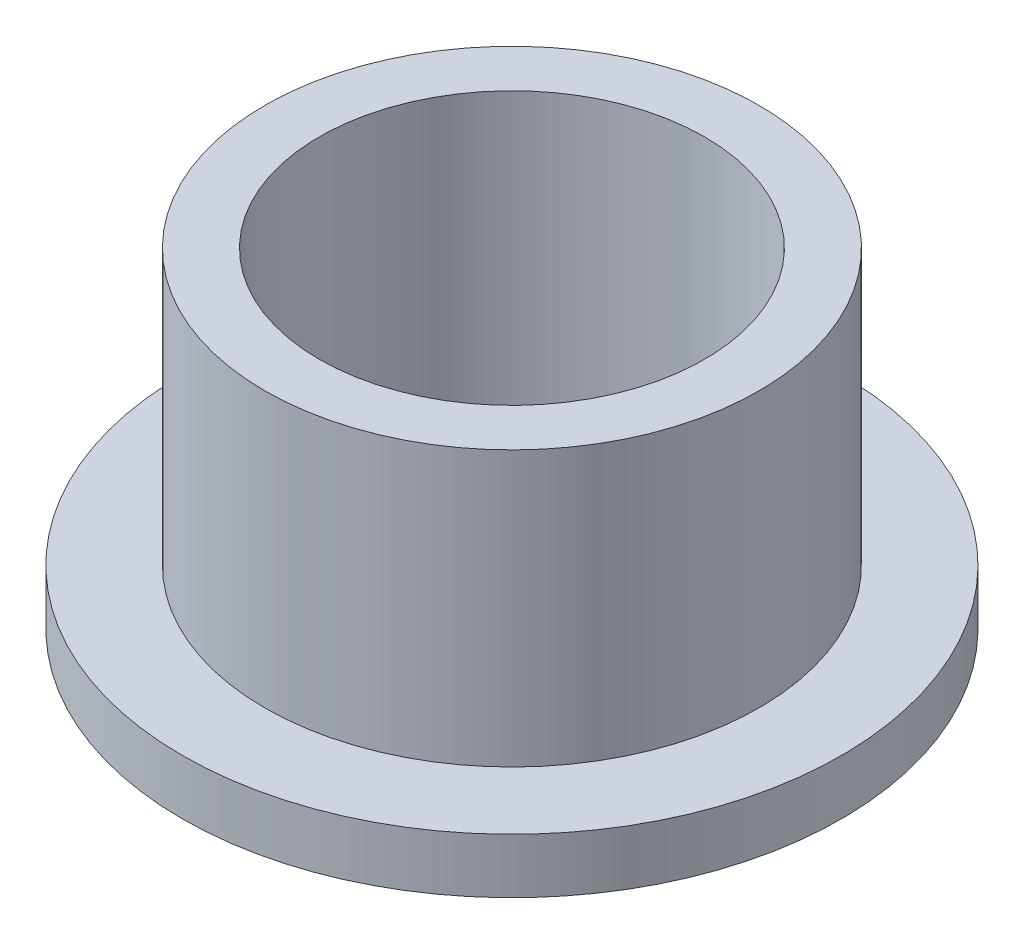
ISO-10303-21;
HEADER;
FILE_DESCRIPTION(('STEP AP214'),'2;1');
FILE_NAME('part.step','',(''),(''),'','','');
FILE_SCHEMA(('AUTOMOTIVE_DESIGN { 1 0 10303 214 1 1 1 1 }'));
ENDSEC;
DATA;
#1=APPLICATION_CONTEXT('core data for automotive mechanical design processes');
#2=APPLICATION_PROTOCOL_DEFINITION('international standard','automotive_design',2000,#1);
#3=PRODUCT_CONTEXT('',#1,'mechanical');
#4=PRODUCT('Part','Part','',(#3));
#5=PRODUCT_RELATED_PRODUCT_CATEGORY('part','',(#4));
#6=PRODUCT_DEFINITION_FORMATION('','',#4);
#7=PRODUCT_DEFINITION_CONTEXT('part definition',#1,'design');
#8=PRODUCT_DEFINITION('design','',#6,#7);
#9=PRODUCT_DEFINITION_SHAPE('','',#8);
#10=(LENGTH_UNIT() NAMED_UNIT(*) SI_UNIT(.MILLI.,.METRE.));
#11=(NAMED_UNIT(*) PLANE_ANGLE_UNIT() SI_UNIT($,.RADIAN.));
#12=(NAMED_UNIT(*) SI_UNIT($,.STERADIAN.) SOLID_ANGLE_UNIT());
#13=UNCERTAINTY_MEASURE_WITH_UNIT(LENGTH_MEASURE(1.E-05),#10,'distance_accuracy_value','');
#14=(GEOMETRIC_REPRESENTATION_CONTEXT(3) GLOBAL_UNCERTAINTY_ASSIGNED_CONTEXT((#13)) GLOBAL_UNIT_ASSIGNED_CONTEXT((#10,
#11,#12)) REPRESENTATION_CONTEXT('',''));
#15=CARTESIAN_POINT('',(0.,0.,0.));
#16=DIRECTION('',(0.,0.,1.));
#17=DIRECTION('',(1.,0.,0.));
#18=AXIS2_PLACEMENT_3D('',#15,#16,#17);
#19=CARTESIAN_POINT('',(0.,19.05,0.));
#20=DIRECTION('',(0.,1.,0.));
#21=DIRECTION('',(0.,0.,1.));
#22=AXIS2_PLACEMENT_3D('',#19,#20,#21);
#23=PLANE('',#22);
#24=CARTESIAN_POINT('',(0.,19.05,0.));
#25=DIRECTION('',(0.,1.,0.));
#26=DIRECTION('',(0.,0.,1.));
#27=AXIS2_PLACEMENT_3D('',#24,#25,#26);
#28=CIRCLE('',#27,14.2875);
#29=CARTESIAN_POINT('',(0.,19.05,14.2875));
#30=VERTEX_POINT('',#29);
#31=EDGE_CURVE('E10',#30,#30,#28,.T.);
#32=ORIENTED_EDGE('',*,*,#31,.T.);
#33=EDGE_LOOP('',(#32));
#34=FACE_BOUND('',#33,.T.);
#35=CARTESIAN_POINT('',(0.,19.05,0.));
#36=DIRECTION('',(0.,1.,0.));
#37=DIRECTION('',(0.,0.,1.));
#38=AXIS2_PLACEMENT_3D('',#35,#36,#37);
#39=CIRCLE('',#38,11.1379);
#40=CARTESIAN_POINT('',(0.,19.05,11.1379));
#41=VERTEX_POINT('',#40);
#42=EDGE_CURVE('E35',#41,#41,#39,.T.);
#43=ORIENTED_EDGE('',*,*,#42,.F.);
#44=EDGE_LOOP('',(#43));
#45=FACE_BOUND('',#44,.T.);
#46=ADVANCED_FACE('F28',(#34,#45),#23,.T.);
#47=CARTESIAN_POINT('',(0.,0.,0.));
#48=DIRECTION('',(0.,1.,0.));
#49=DIRECTION('',(0.,0.,1.));
#50=AXIS2_PLACEMENT_3D('',#47,#48,#49);
#51=PLANE('',#50);
#52=CARTESIAN_POINT('',(0.,0.,0.));
#53=DIRECTION('',(0.,1.,0.));
#54=DIRECTION('',(0.,0.,1.));
#55=AXIS2_PLACEMENT_3D('',#52,#53,#54);
#56=CIRCLE('',#55,11.1379);
#57=CARTESIAN_POINT('',(0.,0.,11.1379));
#58=VERTEX_POINT('',#57);
#59=EDGE_CURVE('E39',#58,#58,#56,.T.);
#60=ORIENTED_EDGE('',*,*,#59,.T.);
#61=EDGE_LOOP('',(#60));
#62=FACE_BOUND('',#61,.T.);
#63=CARTESIAN_POINT('',(0.,0.,0.));
#64=DIRECTION('',(0.,1.,0.));
#65=DIRECTION('',(0.,0.,1.));
#66=AXIS2_PLACEMENT_3D('',#63,#64,#65);
#67=CIRCLE('',#66,19.05);
#68=CARTESIAN_POINT('',(0.,0.,19.05));
#69=VERTEX_POINT('',#68);
#70=EDGE_CURVE('E46',#69,#69,#67,.T.);
#71=ORIENTED_EDGE('',*,*,#70,.F.);
#72=EDGE_LOOP('',(#71));
#73=FACE_BOUND('',#72,.T.);
#74=ADVANCED_FACE('F71',(#62,#73),#51,.F.);
#75=CARTESIAN_POINT('',(0.,19.05,0.));
#76=DIRECTION('',(0.,-1.,0.));
#77=DIRECTION('',(0.,0.,-1.));
#78=AXIS2_PLACEMENT_3D('',#75,#76,#77);
#79=CYLINDRICAL_SURFACE('',#78,14.2875);
#80=CARTESIAN_POINT('',(0.,3.175,0.));
#81=DIRECTION('',(0.,1.,0.));
#82=DIRECTION('',(0.,0.,1.));
#83=AXIS2_PLACEMENT_3D('',#80,#81,#82);
#84=CIRCLE('',#83,14.2875);
#85=CARTESIAN_POINT('',(0.,3.175,14.2875));
#86=VERTEX_POINT('',#85);
#87=EDGE_CURVE('E49',#86,#86,#84,.T.);
#88=ORIENTED_EDGE('',*,*,#87,.T.);
#89=EDGE_LOOP('',(#88));
#90=FACE_BOUND('',#89,.T.);
#91=ORIENTED_EDGE('',*,*,#31,.F.);
#92=EDGE_LOOP('',(#91));
#93=FACE_BOUND('',#92,.T.);
#94=ADVANCED_FACE('F30',(#90,#93),#79,.T.);
#95=CARTESIAN_POINT('',(0.,19.05,0.));
#96=DIRECTION('',(0.,-1.,0.));
#97=DIRECTION('',(0.,0.,-1.));
#98=AXIS2_PLACEMENT_3D('',#95,#96,#97);
#99=CYLINDRICAL_SURFACE('',#98,11.1379);
#100=ORIENTED_EDGE('',*,*,#42,.T.);
#101=EDGE_LOOP('',(#100));
#102=FACE_BOUND('',#101,.T.);
#103=ORIENTED_EDGE('',*,*,#59,.F.);
#104=EDGE_LOOP('',(#103));
#105=FACE_BOUND('',#104,.T.);
#106=ADVANCED_FACE('F60',(#102,#105),#99,.F.);
#107=CARTESIAN_POINT('',(0.,3.175,0.));
#108=DIRECTION('',(0.,1.,0.));
#109=DIRECTION('',(0.,0.,1.));
#110=AXIS2_PLACEMENT_3D('',#107,#108,#109);
#111=PLANE('',#110);
#112=CARTESIAN_POINT('',(0.,3.175,0.));
#113=DIRECTION('',(0.,1.,0.));
#114=DIRECTION('',(0.,0.,1.));
#115=AXIS2_PLACEMENT_3D('',#112,#113,#114);
#116=CIRCLE('',#115,19.05);
#117=CARTESIAN_POINT('',(0.,3.175,19.05));
#118=VERTEX_POINT('',#117);
#119=EDGE_CURVE('E44',#118,#118,#116,.T.);
#120=ORIENTED_EDGE('',*,*,#119,.T.);
#121=EDGE_LOOP('',(#120));
#122=FACE_BOUND('',#121,.T.);
#123=ORIENTED_EDGE('',*,*,#87,.F.);
#124=EDGE_LOOP('',(#123));
#125=FACE_BOUND('',#124,.T.);
#126=ADVANCED_FACE('F57',(#122,#125),#111,.T.);
#127=CARTESIAN_POINT('',(0.,3.175,0.));
#128=DIRECTION('',(0.,-1.,0.));
#129=DIRECTION('',(0.,0.,-1.));
#130=AXIS2_PLACEMENT_3D('',#127,#128,#129);
#131=CYLINDRICAL_SURFACE('',#130,19.05);
#132=ORIENTED_EDGE('',*,*,#119,.F.);
#133=EDGE_LOOP('',(#132));
#134=FACE_BOUND('',#133,.T.);
#135=ORIENTED_EDGE('',*,*,#70,.T.);
#136=EDGE_LOOP('',(#135));
#137=FACE_BOUND('',#136,.T.);
#138=ADVANCED_FACE('F59',(#134,#137),#131,.T.);
#139=CLOSED_SHELL('',(#46,#74,#94,#106,#126,#138));
#140=MANIFOLD_SOLID_BREP('B2',#139);
#141=ADVANCED_BREP_SHAPE_REPRESENTATION('',(#18,#140),#14);
#142=SHAPE_DEFINITION_REPRESENTATION(#9,#141);
ENDSEC;
END-ISO-10303-21;
